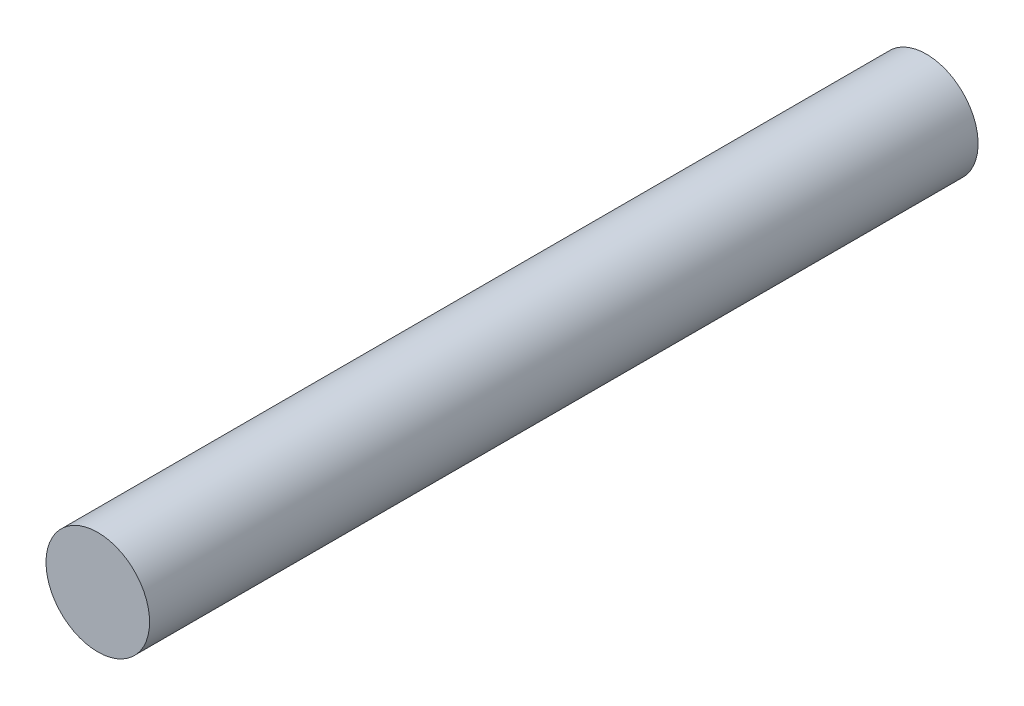
ISO-10303-21;
HEADER;
FILE_DESCRIPTION(('STEP AP214'),'2;1');
FILE_NAME('part.step','',(''),(''),'','','');
FILE_SCHEMA(('AUTOMOTIVE_DESIGN { 1 0 10303 214 1 1 1 1 }'));
ENDSEC;
DATA;
#1=APPLICATION_CONTEXT('core data for automotive mechanical design processes');
#2=APPLICATION_PROTOCOL_DEFINITION('international standard','automotive_design',2000,#1);
#3=PRODUCT_CONTEXT('',#1,'mechanical');
#4=PRODUCT('Part','Part','',(#3));
#5=PRODUCT_RELATED_PRODUCT_CATEGORY('part','',(#4));
#6=PRODUCT_DEFINITION_FORMATION('','',#4);
#7=PRODUCT_DEFINITION_CONTEXT('part definition',#1,'design');
#8=PRODUCT_DEFINITION('design','',#6,#7);
#9=PRODUCT_DEFINITION_SHAPE('','',#8);
#10=(LENGTH_UNIT() NAMED_UNIT(*) SI_UNIT(.MILLI.,.METRE.));
#11=(NAMED_UNIT(*) PLANE_ANGLE_UNIT() SI_UNIT($,.RADIAN.));
#12=(NAMED_UNIT(*) SI_UNIT($,.STERADIAN.) SOLID_ANGLE_UNIT());
#13=UNCERTAINTY_MEASURE_WITH_UNIT(LENGTH_MEASURE(1.E-05),#10,'distance_accuracy_value','');
#14=(GEOMETRIC_REPRESENTATION_CONTEXT(3) GLOBAL_UNCERTAINTY_ASSIGNED_CONTEXT((#13)) GLOBAL_UNIT_ASSIGNED_CONTEXT((#10,
#11,#12)) REPRESENTATION_CONTEXT('',''));
#15=CARTESIAN_POINT('',(0.,0.,0.));
#16=DIRECTION('',(0.,0.,1.));
#17=DIRECTION('',(1.,0.,0.));
#18=AXIS2_PLACEMENT_3D('',#15,#16,#17);
#19=CARTESIAN_POINT('',(0.,0.,78.717628264741));
#20=DIRECTION('',(0.,0.,1.));
#21=DIRECTION('',(1.,0.,0.));
#22=AXIS2_PLACEMENT_3D('',#19,#20,#21);
#23=PLANE('',#22);
#24=CARTESIAN_POINT('',(0.,0.,78.717628264741));
#25=DIRECTION('',(0.,0.,1.));
#26=DIRECTION('',(1.,0.,0.));
#27=AXIS2_PLACEMENT_3D('',#24,#25,#26);
#28=CIRCLE('',#27,6.35);
#29=CARTESIAN_POINT('',(6.34999999999995,0.,78.717628264741));
#30=VERTEX_POINT('',#29);
#31=EDGE_CURVE('E11',#30,#30,#28,.F.);
#32=ORIENTED_EDGE('',*,*,#31,.F.);
#33=EDGE_LOOP('',(#32));
#34=FACE_BOUND('',#33,.T.);
#35=ADVANCED_FACE('F44',(#34),#23,.T.);
#36=CARTESIAN_POINT('',(0.,0.,-22.86));
#37=DIRECTION('',(0.,0.,-1.));
#38=DIRECTION('',(-1.,0.,0.));
#39=AXIS2_PLACEMENT_3D('',#36,#37,#38);
#40=PLANE('',#39);
#41=CARTESIAN_POINT('',(0.,0.,-22.86));
#42=DIRECTION('',(0.,0.,-1.));
#43=DIRECTION('',(-1.,0.,0.));
#44=AXIS2_PLACEMENT_3D('',#41,#42,#43);
#45=CIRCLE('',#44,6.35);
#46=CARTESIAN_POINT('',(-6.35,0.,-22.86));
#47=VERTEX_POINT('',#46);
#48=EDGE_CURVE('E50',#47,#47,#45,.T.);
#49=ORIENTED_EDGE('',*,*,#48,.T.);
#50=EDGE_LOOP('',(#49));
#51=FACE_BOUND('',#50,.T.);
#52=ADVANCED_FACE('F56',(#51),#40,.T.);
#53=CARTESIAN_POINT('',(0.,0.,96.6781405068793));
#54=DIRECTION('',(0.,0.,-1.));
#55=DIRECTION('',(-1.,0.,0.));
#56=AXIS2_PLACEMENT_3D('',#53,#54,#55);
#57=CYLINDRICAL_SURFACE('',#56,6.35);
#58=ORIENTED_EDGE('',*,*,#48,.F.);
#59=EDGE_LOOP('',(#58));
#60=FACE_BOUND('',#59,.T.);
#61=ORIENTED_EDGE('',*,*,#31,.T.);
#62=EDGE_LOOP('',(#61));
#63=FACE_BOUND('',#62,.T.);
#64=ADVANCED_FACE('F58',(#60,#63),#57,.T.);
#65=CLOSED_SHELL('',(#35,#52,#64));
#66=MANIFOLD_SOLID_BREP('B2',#65);
#67=ADVANCED_BREP_SHAPE_REPRESENTATION('',(#18,#66),#14);
#68=SHAPE_DEFINITION_REPRESENTATION(#9,#67);
ENDSEC;
END-ISO-10303-21;
